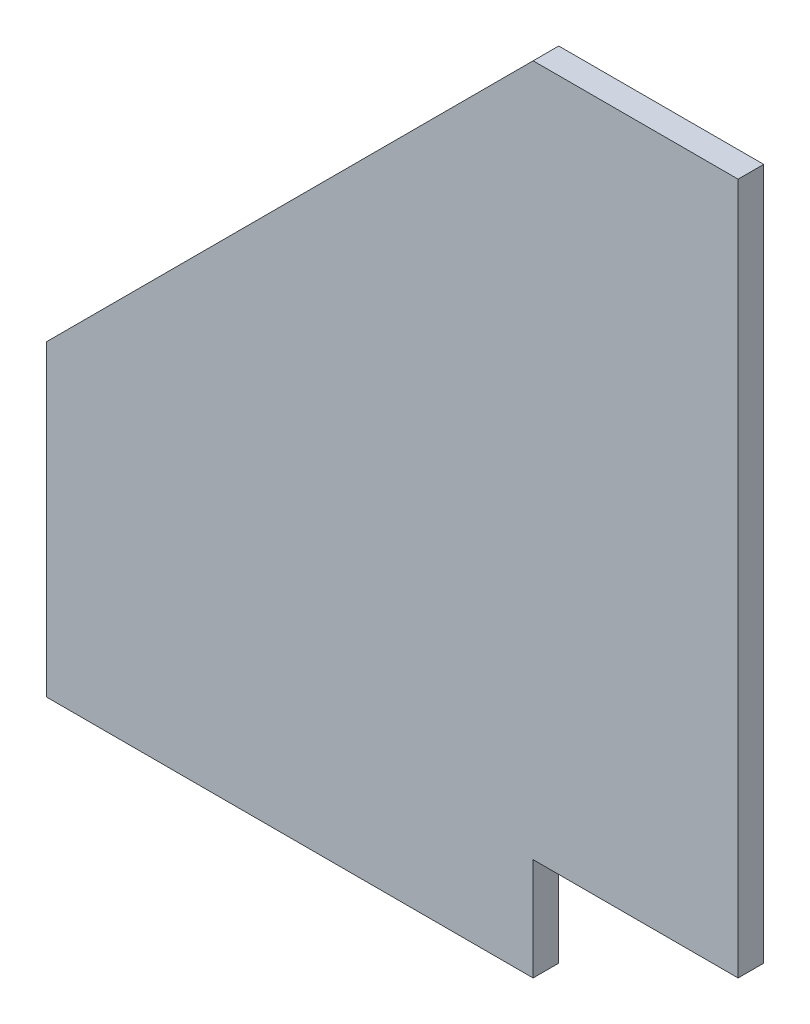
ISO-10303-21;
HEADER;
FILE_DESCRIPTION(('STEP AP214'),'2;1');
FILE_NAME('part.step','',(''),(''),'','','');
FILE_SCHEMA(('AUTOMOTIVE_DESIGN { 1 0 10303 214 1 1 1 1 }'));
ENDSEC;
DATA;
#1=APPLICATION_CONTEXT('core data for automotive mechanical design processes');
#2=APPLICATION_PROTOCOL_DEFINITION('international standard','automotive_design',2000,#1);
#3=PRODUCT_CONTEXT('',#1,'mechanical');
#4=PRODUCT('Part','Part','',(#3));
#5=PRODUCT_RELATED_PRODUCT_CATEGORY('part','',(#4));
#6=PRODUCT_DEFINITION_FORMATION('','',#4);
#7=PRODUCT_DEFINITION_CONTEXT('part definition',#1,'design');
#8=PRODUCT_DEFINITION('design','',#6,#7);
#9=PRODUCT_DEFINITION_SHAPE('','',#8);
#10=(LENGTH_UNIT() NAMED_UNIT(*) SI_UNIT(.MILLI.,.METRE.));
#11=(NAMED_UNIT(*) PLANE_ANGLE_UNIT() SI_UNIT($,.RADIAN.));
#12=(NAMED_UNIT(*) SI_UNIT($,.STERADIAN.) SOLID_ANGLE_UNIT());
#13=UNCERTAINTY_MEASURE_WITH_UNIT(LENGTH_MEASURE(1.E-05),#10,'distance_accuracy_value','');
#14=(GEOMETRIC_REPRESENTATION_CONTEXT(3) GLOBAL_UNCERTAINTY_ASSIGNED_CONTEXT((#13)) GLOBAL_UNIT_ASSIGNED_CONTEXT((#10,
#11,#12)) REPRESENTATION_CONTEXT('',''));
#15=CARTESIAN_POINT('',(0.,0.,0.));
#16=DIRECTION('',(0.,0.,1.));
#17=DIRECTION('',(1.,0.,0.));
#18=AXIS2_PLACEMENT_3D('',#15,#16,#17);
#19=CARTESIAN_POINT('',(0.,76.1999999999993,3.175));
#20=DIRECTION('',(1.,0.,0.));
#21=DIRECTION('',(0.,0.,-1.));
#22=AXIS2_PLACEMENT_3D('',#19,#20,#21);
#23=PLANE('',#22);
#24=DIRECTION('',(0.,-1.,0.));
#25=VECTOR('',#24,1.);
#26=CARTESIAN_POINT('',(0.,76.1999999999993,-3.175));
#27=LINE('',#26,#25);
#28=CARTESIAN_POINT('',(0.,76.1999999999993,-3.175));
#29=VERTEX_POINT('',#28);
#30=CARTESIAN_POINT('',(0.,0.,-3.175));
#31=VERTEX_POINT('',#30);
#32=EDGE_CURVE('E140',#29,#31,#27,.T.);
#33=ORIENTED_EDGE('',*,*,#32,.T.);
#34=DIRECTION('',(0.,0.,-1.));
#35=VECTOR('',#34,1.);
#36=CARTESIAN_POINT('',(0.,0.,3.175));
#37=LINE('',#36,#35);
#38=CARTESIAN_POINT('',(0.,0.,3.175));
#39=VERTEX_POINT('',#38);
#40=EDGE_CURVE('E11',#39,#31,#37,.T.);
#41=ORIENTED_EDGE('',*,*,#40,.F.);
#42=DIRECTION('',(0.,-1.,0.));
#43=VECTOR('',#42,1.);
#44=CARTESIAN_POINT('',(0.,76.1999999999993,3.175));
#45=LINE('',#44,#43);
#46=CARTESIAN_POINT('',(0.,76.1999999999993,3.175));
#47=VERTEX_POINT('',#46);
#48=EDGE_CURVE('E159',#47,#39,#45,.T.);
#49=ORIENTED_EDGE('',*,*,#48,.F.);
#50=DIRECTION('',(0.,0.,-1.));
#51=VECTOR('',#50,1.);
#52=CARTESIAN_POINT('',(0.,76.1999999999993,3.175));
#53=LINE('',#52,#51);
#54=EDGE_CURVE('E136',#47,#29,#53,.T.);
#55=ORIENTED_EDGE('',*,*,#54,.T.);
#56=EDGE_LOOP('',(#33,#41,#49,#55));
#57=FACE_BOUND('',#56,.T.);
#58=ADVANCED_FACE('F45',(#57),#23,.F.);
#59=CARTESIAN_POINT('',(0.,0.,3.175));
#60=DIRECTION('',(0.,1.,0.));
#61=DIRECTION('',(0.,0.,1.));
#62=AXIS2_PLACEMENT_3D('',#59,#60,#61);
#63=PLANE('',#62);
#64=DIRECTION('',(1.,0.,0.));
#65=VECTOR('',#64,1.);
#66=CARTESIAN_POINT('',(0.,0.,-3.175));
#67=LINE('',#66,#65);
#68=CARTESIAN_POINT('',(120.65,0.,-3.175));
#69=VERTEX_POINT('',#68);
#70=EDGE_CURVE('E144',#31,#69,#67,.T.);
#71=ORIENTED_EDGE('',*,*,#70,.T.);
#72=DIRECTION('',(0.,0.,-1.));
#73=VECTOR('',#72,1.);
#74=CARTESIAN_POINT('',(120.65,0.,3.175));
#75=LINE('',#74,#73);
#76=CARTESIAN_POINT('',(120.65,0.,3.175));
#77=VERTEX_POINT('',#76);
#78=EDGE_CURVE('E54',#77,#69,#75,.T.);
#79=ORIENTED_EDGE('',*,*,#78,.F.);
#80=DIRECTION('',(1.,0.,0.));
#81=VECTOR('',#80,1.);
#82=CARTESIAN_POINT('',(0.,0.,3.175));
#83=LINE('',#82,#81);
#84=EDGE_CURVE('E102',#39,#77,#83,.T.);
#85=ORIENTED_EDGE('',*,*,#84,.F.);
#86=ORIENTED_EDGE('',*,*,#40,.T.);
#87=EDGE_LOOP('',(#71,#79,#85,#86));
#88=FACE_BOUND('',#87,.T.);
#89=ADVANCED_FACE('F193',(#88),#63,.F.);
#90=CARTESIAN_POINT('',(120.65,0.,3.175));
#91=DIRECTION('',(-1.,0.,0.));
#92=DIRECTION('',(0.,0.,1.));
#93=AXIS2_PLACEMENT_3D('',#90,#91,#92);
#94=PLANE('',#93);
#95=DIRECTION('',(0.,1.,0.));
#96=VECTOR('',#95,1.);
#97=CARTESIAN_POINT('',(120.65,0.,-3.175));
#98=LINE('',#97,#96);
#99=CARTESIAN_POINT('',(120.65,25.4,-3.175));
#100=VERTEX_POINT('',#99);
#101=EDGE_CURVE('E147',#69,#100,#98,.T.);
#102=ORIENTED_EDGE('',*,*,#101,.T.);
#103=DIRECTION('',(0.,0.,-1.));
#104=VECTOR('',#103,1.);
#105=CARTESIAN_POINT('',(120.65,25.4,3.175));
#106=LINE('',#105,#104);
#107=CARTESIAN_POINT('',(120.65,25.4,3.175));
#108=VERTEX_POINT('',#107);
#109=EDGE_CURVE('E166',#108,#100,#106,.T.);
#110=ORIENTED_EDGE('',*,*,#109,.F.);
#111=DIRECTION('',(0.,1.,0.));
#112=VECTOR('',#111,1.);
#113=CARTESIAN_POINT('',(120.65,0.,3.175));
#114=LINE('',#113,#112);
#115=EDGE_CURVE('E176',#77,#108,#114,.T.);
#116=ORIENTED_EDGE('',*,*,#115,.F.);
#117=ORIENTED_EDGE('',*,*,#78,.T.);
#118=EDGE_LOOP('',(#102,#110,#116,#117));
#119=FACE_BOUND('',#118,.T.);
#120=ADVANCED_FACE('F174',(#119),#94,.F.);
#121=CARTESIAN_POINT('',(120.65,25.4,3.175));
#122=DIRECTION('',(0.,1.,0.));
#123=DIRECTION('',(0.,0.,1.));
#124=AXIS2_PLACEMENT_3D('',#121,#122,#123);
#125=PLANE('',#124);
#126=DIRECTION('',(1.,0.,0.));
#127=VECTOR('',#126,1.);
#128=CARTESIAN_POINT('',(120.65,25.4,-3.175));
#129=LINE('',#128,#127);
#130=CARTESIAN_POINT('',(171.45,25.4,-3.175));
#131=VERTEX_POINT('',#130);
#132=EDGE_CURVE('E150',#100,#131,#129,.T.);
#133=ORIENTED_EDGE('',*,*,#132,.T.);
#134=DIRECTION('',(0.,0.,-1.));
#135=VECTOR('',#134,1.);
#136=CARTESIAN_POINT('',(171.45,25.4,3.175));
#137=LINE('',#136,#135);
#138=CARTESIAN_POINT('',(171.45,25.4,3.175));
#139=VERTEX_POINT('',#138);
#140=EDGE_CURVE('E129',#139,#131,#137,.T.);
#141=ORIENTED_EDGE('',*,*,#140,.F.);
#142=DIRECTION('',(1.,0.,0.));
#143=VECTOR('',#142,1.);
#144=CARTESIAN_POINT('',(120.65,25.4,3.175));
#145=LINE('',#144,#143);
#146=EDGE_CURVE('E118',#108,#139,#145,.T.);
#147=ORIENTED_EDGE('',*,*,#146,.F.);
#148=ORIENTED_EDGE('',*,*,#109,.T.);
#149=EDGE_LOOP('',(#133,#141,#147,#148));
#150=FACE_BOUND('',#149,.T.);
#151=ADVANCED_FACE('F182',(#150),#125,.F.);
#152=CARTESIAN_POINT('',(171.45,25.4,3.175));
#153=DIRECTION('',(-1.,0.,0.));
#154=DIRECTION('',(0.,0.,1.));
#155=AXIS2_PLACEMENT_3D('',#152,#153,#154);
#156=PLANE('',#155);
#157=DIRECTION('',(0.,1.,0.));
#158=VECTOR('',#157,1.);
#159=CARTESIAN_POINT('',(171.45,25.4,-3.175));
#160=LINE('',#159,#158);
#161=CARTESIAN_POINT('',(171.45,196.85,-3.175));
#162=VERTEX_POINT('',#161);
#163=EDGE_CURVE('E127',#131,#162,#160,.T.);
#164=ORIENTED_EDGE('',*,*,#163,.T.);
#165=DIRECTION('',(0.,0.,-1.));
#166=VECTOR('',#165,1.);
#167=CARTESIAN_POINT('',(171.45,196.85,3.175));
#168=LINE('',#167,#166);
#169=CARTESIAN_POINT('',(171.45,196.85,3.175));
#170=VERTEX_POINT('',#169);
#171=EDGE_CURVE('E124',#170,#162,#168,.T.);
#172=ORIENTED_EDGE('',*,*,#171,.F.);
#173=DIRECTION('',(0.,1.,0.));
#174=VECTOR('',#173,1.);
#175=CARTESIAN_POINT('',(171.45,25.4,3.175));
#176=LINE('',#175,#174);
#177=EDGE_CURVE('E112',#139,#170,#176,.T.);
#178=ORIENTED_EDGE('',*,*,#177,.F.);
#179=ORIENTED_EDGE('',*,*,#140,.T.);
#180=EDGE_LOOP('',(#164,#172,#178,#179));
#181=FACE_BOUND('',#180,.T.);
#182=ADVANCED_FACE('F125',(#181),#156,.F.);
#183=CARTESIAN_POINT('',(171.45,196.85,3.175));
#184=DIRECTION('',(0.,-1.,0.));
#185=DIRECTION('',(0.,0.,-1.));
#186=AXIS2_PLACEMENT_3D('',#183,#184,#185);
#187=PLANE('',#186);
#188=DIRECTION('',(-1.,0.,0.));
#189=VECTOR('',#188,1.);
#190=CARTESIAN_POINT('',(171.45,196.85,-3.175));
#191=LINE('',#190,#189);
#192=CARTESIAN_POINT('',(120.65,196.85,-3.175));
#193=VERTEX_POINT('',#192);
#194=EDGE_CURVE('E88',#162,#193,#191,.T.);
#195=ORIENTED_EDGE('',*,*,#194,.T.);
#196=DIRECTION('',(0.,0.,-1.));
#197=VECTOR('',#196,1.);
#198=CARTESIAN_POINT('',(120.65,196.85,3.175));
#199=LINE('',#198,#197);
#200=CARTESIAN_POINT('',(120.65,196.85,3.175));
#201=VERTEX_POINT('',#200);
#202=EDGE_CURVE('E130',#201,#193,#199,.T.);
#203=ORIENTED_EDGE('',*,*,#202,.F.);
#204=DIRECTION('',(-1.,0.,0.));
#205=VECTOR('',#204,1.);
#206=CARTESIAN_POINT('',(171.45,196.85,3.175));
#207=LINE('',#206,#205);
#208=EDGE_CURVE('E116',#170,#201,#207,.T.);
#209=ORIENTED_EDGE('',*,*,#208,.F.);
#210=ORIENTED_EDGE('',*,*,#171,.T.);
#211=EDGE_LOOP('',(#195,#203,#209,#210));
#212=FACE_BOUND('',#211,.T.);
#213=ADVANCED_FACE('F132',(#212),#187,.F.);
#214=CARTESIAN_POINT('',(120.65,196.85,3.175));
#215=DIRECTION('',(0.70710678118655,-0.707106781186545,0.));
#216=DIRECTION('',(0.707106781186545,0.70710678118655,0.));
#217=AXIS2_PLACEMENT_3D('',#214,#215,#216);
#218=PLANE('',#217);
#219=DIRECTION('',(-0.707106781186545,-0.70710678118655,0.));
#220=VECTOR('',#219,1.);
#221=CARTESIAN_POINT('',(120.65,196.85,-3.175));
#222=LINE('',#221,#220);
#223=EDGE_CURVE('E94',#193,#29,#222,.T.);
#224=ORIENTED_EDGE('',*,*,#223,.T.);
#225=ORIENTED_EDGE('',*,*,#54,.F.);
#226=DIRECTION('',(-0.707106781186545,-0.70710678118655,0.));
#227=VECTOR('',#226,1.);
#228=CARTESIAN_POINT('',(120.65,196.85,3.175));
#229=LINE('',#228,#227);
#230=EDGE_CURVE('E62',#201,#47,#229,.T.);
#231=ORIENTED_EDGE('',*,*,#230,.F.);
#232=ORIENTED_EDGE('',*,*,#202,.T.);
#233=EDGE_LOOP('',(#224,#225,#231,#232));
#234=FACE_BOUND('',#233,.T.);
#235=ADVANCED_FACE('F207',(#234),#218,.F.);
#236=CARTESIAN_POINT('',(0.,0.,3.175));
#237=DIRECTION('',(0.,0.,1.));
#238=DIRECTION('',(1.,0.,0.));
#239=AXIS2_PLACEMENT_3D('',#236,#237,#238);
#240=PLANE('',#239);
#241=ORIENTED_EDGE('',*,*,#48,.T.);
#242=ORIENTED_EDGE('',*,*,#84,.T.);
#243=ORIENTED_EDGE('',*,*,#115,.T.);
#244=ORIENTED_EDGE('',*,*,#146,.T.);
#245=ORIENTED_EDGE('',*,*,#177,.T.);
#246=ORIENTED_EDGE('',*,*,#208,.T.);
#247=ORIENTED_EDGE('',*,*,#230,.T.);
#248=EDGE_LOOP('',(#241,#242,#243,#244,#245,#246,#247));
#249=FACE_BOUND('',#248,.T.);
#250=ADVANCED_FACE('F114',(#249),#240,.T.);
#251=CARTESIAN_POINT('',(0.,0.,-3.175));
#252=DIRECTION('',(0.,0.,1.));
#253=DIRECTION('',(1.,0.,0.));
#254=AXIS2_PLACEMENT_3D('',#251,#252,#253);
#255=PLANE('',#254);
#256=ORIENTED_EDGE('',*,*,#32,.F.);
#257=ORIENTED_EDGE('',*,*,#223,.F.);
#258=ORIENTED_EDGE('',*,*,#194,.F.);
#259=ORIENTED_EDGE('',*,*,#163,.F.);
#260=ORIENTED_EDGE('',*,*,#132,.F.);
#261=ORIENTED_EDGE('',*,*,#101,.F.);
#262=ORIENTED_EDGE('',*,*,#70,.F.);
#263=EDGE_LOOP('',(#256,#257,#258,#259,#260,#261,#262));
#264=FACE_BOUND('',#263,.T.);
#265=ADVANCED_FACE('F180',(#264),#255,.F.);
#266=CLOSED_SHELL('',(#58,#89,#120,#151,#182,#213,#235,#250,#265));
#267=MANIFOLD_SOLID_BREP('B2',#266);
#268=ADVANCED_BREP_SHAPE_REPRESENTATION('',(#18,#267),#14);
#269=SHAPE_DEFINITION_REPRESENTATION(#9,#268);
ENDSEC;
END-ISO-10303-21;
